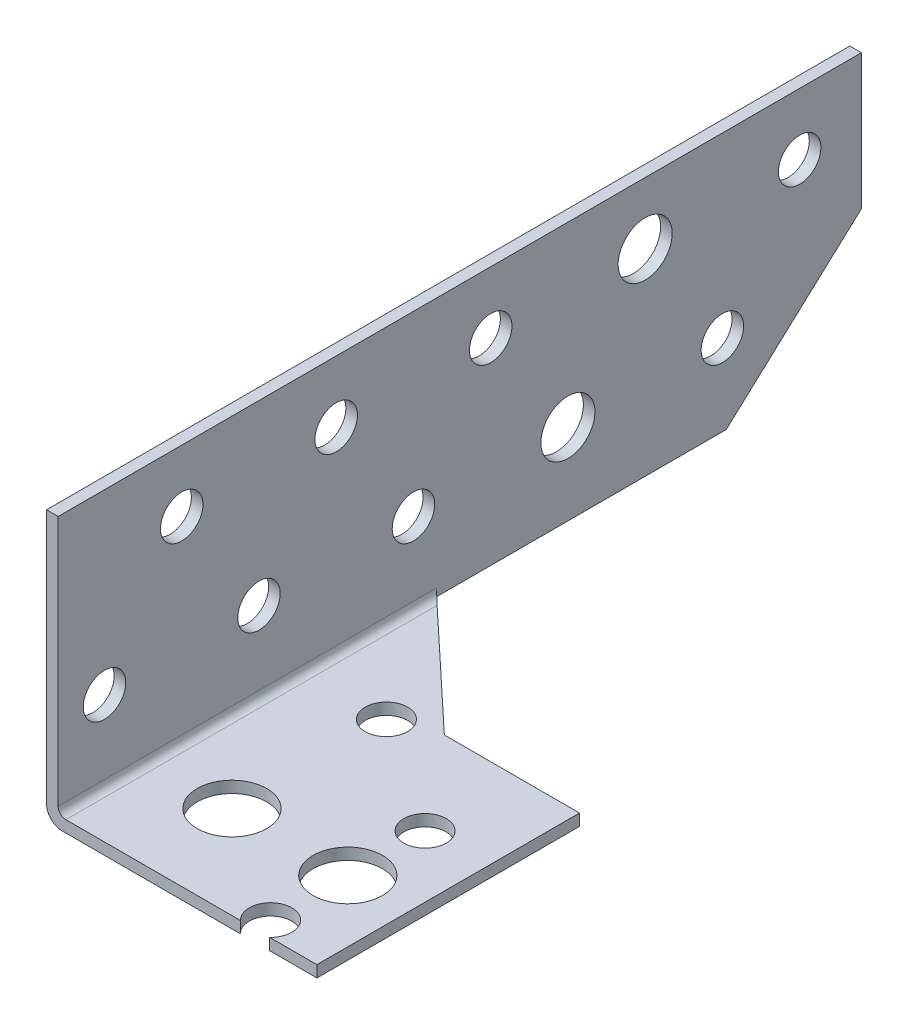
ISO-10303-21;
HEADER;
FILE_DESCRIPTION(('STEP AP214'),'2;1');
FILE_NAME('part.step','',(''),(''),'','','');
FILE_SCHEMA(('AUTOMOTIVE_DESIGN { 1 0 10303 214 1 1 1 1 }'));
ENDSEC;
DATA;
#1=APPLICATION_CONTEXT('core data for automotive mechanical design processes');
#2=APPLICATION_PROTOCOL_DEFINITION('international standard','automotive_design',2000,#1);
#3=PRODUCT_CONTEXT('',#1,'mechanical');
#4=PRODUCT('Part','Part','',(#3));
#5=PRODUCT_RELATED_PRODUCT_CATEGORY('part','',(#4));
#6=PRODUCT_DEFINITION_FORMATION('','',#4);
#7=PRODUCT_DEFINITION_CONTEXT('part definition',#1,'design');
#8=PRODUCT_DEFINITION('design','',#6,#7);
#9=PRODUCT_DEFINITION_SHAPE('','',#8);
#10=(LENGTH_UNIT() NAMED_UNIT(*) SI_UNIT(.MILLI.,.METRE.));
#11=(NAMED_UNIT(*) PLANE_ANGLE_UNIT() SI_UNIT($,.RADIAN.));
#12=(NAMED_UNIT(*) SI_UNIT($,.STERADIAN.) SOLID_ANGLE_UNIT());
#13=UNCERTAINTY_MEASURE_WITH_UNIT(LENGTH_MEASURE(1.E-05),#10,'distance_accuracy_value','');
#14=(GEOMETRIC_REPRESENTATION_CONTEXT(3) GLOBAL_UNCERTAINTY_ASSIGNED_CONTEXT((#13)) GLOBAL_UNIT_ASSIGNED_CONTEXT((#10,
#11,#12)) REPRESENTATION_CONTEXT('',''));
#15=CARTESIAN_POINT('',(0.,0.,0.));
#16=DIRECTION('',(0.,0.,1.));
#17=DIRECTION('',(1.,0.,0.));
#18=AXIS2_PLACEMENT_3D('',#15,#16,#17);
#19=CARTESIAN_POINT('',(-0.75,0.,210.));
#20=DIRECTION('',(1.,0.,0.));
#21=DIRECTION('',(0.,1.,0.));
#22=AXIS2_PLACEMENT_3D('',#19,#20,#21);
#23=PLANE('',#22);
#24=CARTESIAN_POINT('',(-0.750000000000001,9.5,28.));
#25=DIRECTION('',(1.,0.,0.));
#26=DIRECTION('',(0.,1.,0.));
#27=AXIS2_PLACEMENT_3D('',#24,#25,#26);
#28=CIRCLE('',#27,3.5);
#29=CARTESIAN_POINT('',(-0.750000000000001,13.,28.));
#30=VERTEX_POINT('',#29);
#31=EDGE_CURVE('E332',#30,#30,#28,.T.);
#32=ORIENTED_EDGE('',*,*,#31,.T.);
#33=EDGE_LOOP('',(#32));
#34=FACE_BOUND('',#33,.T.);
#35=CARTESIAN_POINT('',(-0.749999999999999,-5.5,38.));
#36=DIRECTION('',(1.,0.,0.));
#37=DIRECTION('',(0.,1.,0.));
#38=AXIS2_PLACEMENT_3D('',#35,#36,#37);
#39=CIRCLE('',#38,3.5);
#40=CARTESIAN_POINT('',(-0.749999999999999,-2.,38.));
#41=VERTEX_POINT('',#40);
#42=EDGE_CURVE('E336',#41,#41,#39,.T.);
#43=ORIENTED_EDGE('',*,*,#42,.T.);
#44=EDGE_LOOP('',(#43));
#45=FACE_BOUND('',#44,.T.);
#46=CARTESIAN_POINT('',(-0.749999999999999,-5.5,18.));
#47=DIRECTION('',(1.,0.,0.));
#48=DIRECTION('',(0.,1.,0.));
#49=AXIS2_PLACEMENT_3D('',#46,#47,#48);
#50=CIRCLE('',#49,2.75);
#51=CARTESIAN_POINT('',(-0.749999999999999,-2.75,18.));
#52=VERTEX_POINT('',#51);
#53=EDGE_CURVE('E257',#52,#52,#50,.T.);
#54=ORIENTED_EDGE('',*,*,#53,.T.);
#55=EDGE_LOOP('',(#54));
#56=FACE_BOUND('',#55,.T.);
#57=CARTESIAN_POINT('',(-0.750000000000001,9.49999999999999,88.));
#58=DIRECTION('',(1.,0.,0.));
#59=DIRECTION('',(0.,1.,0.));
#60=AXIS2_PLACEMENT_3D('',#57,#58,#59);
#61=CIRCLE('',#60,2.75000000000001);
#62=CARTESIAN_POINT('',(-0.750000000000002,12.25,88.));
#63=VERTEX_POINT('',#62);
#64=EDGE_CURVE('E254',#63,#63,#61,.T.);
#65=ORIENTED_EDGE('',*,*,#64,.T.);
#66=EDGE_LOOP('',(#65));
#67=FACE_BOUND('',#66,.T.);
#68=CARTESIAN_POINT('',(-0.750000000000001,9.49999999999999,68.));
#69=DIRECTION('',(1.,0.,0.));
#70=DIRECTION('',(0.,1.,0.));
#71=AXIS2_PLACEMENT_3D('',#68,#69,#70);
#72=CIRCLE('',#71,2.75000000000001);
#73=CARTESIAN_POINT('',(-0.750000000000002,12.25,68.));
#74=VERTEX_POINT('',#73);
#75=EDGE_CURVE('E251',#74,#74,#72,.T.);
#76=ORIENTED_EDGE('',*,*,#75,.T.);
#77=EDGE_LOOP('',(#76));
#78=FACE_BOUND('',#77,.T.);
#79=CARTESIAN_POINT('',(-0.750000000000001,9.5,48.));
#80=DIRECTION('',(1.,0.,0.));
#81=DIRECTION('',(0.,1.,0.));
#82=AXIS2_PLACEMENT_3D('',#79,#80,#81);
#83=CIRCLE('',#82,2.75);
#84=CARTESIAN_POINT('',(-0.750000000000002,12.25,48.));
#85=VERTEX_POINT('',#84);
#86=EDGE_CURVE('E248',#85,#85,#83,.T.);
#87=ORIENTED_EDGE('',*,*,#86,.T.);
#88=EDGE_LOOP('',(#87));
#89=FACE_BOUND('',#88,.T.);
#90=CARTESIAN_POINT('',(-0.749999999999999,-5.5,58.));
#91=DIRECTION('',(1.,0.,0.));
#92=DIRECTION('',(0.,1.,0.));
#93=AXIS2_PLACEMENT_3D('',#90,#91,#92);
#94=CIRCLE('',#93,2.75);
#95=CARTESIAN_POINT('',(-0.749999999999999,-2.75,58.));
#96=VERTEX_POINT('',#95);
#97=EDGE_CURVE('E245',#96,#96,#94,.T.);
#98=ORIENTED_EDGE('',*,*,#97,.T.);
#99=EDGE_LOOP('',(#98));
#100=FACE_BOUND('',#99,.T.);
#101=CARTESIAN_POINT('',(-0.749999999999999,-5.5,78.));
#102=DIRECTION('',(1.,0.,0.));
#103=DIRECTION('',(0.,1.,0.));
#104=AXIS2_PLACEMENT_3D('',#101,#102,#103);
#105=CIRCLE('',#104,2.75000000000001);
#106=CARTESIAN_POINT('',(-0.749999999999999,-2.74999999999999,78.));
#107=VERTEX_POINT('',#106);
#108=EDGE_CURVE('E242',#107,#107,#105,.T.);
#109=ORIENTED_EDGE('',*,*,#108,.T.);
#110=EDGE_LOOP('',(#109));
#111=FACE_BOUND('',#110,.T.);
#112=CARTESIAN_POINT('',(-0.749999999999999,-5.5,98.));
#113=DIRECTION('',(1.,0.,0.));
#114=DIRECTION('',(0.,1.,0.));
#115=AXIS2_PLACEMENT_3D('',#112,#113,#114);
#116=CIRCLE('',#115,2.75000000000001);
#117=CARTESIAN_POINT('',(-0.749999999999999,-2.74999999999999,98.));
#118=VERTEX_POINT('',#117);
#119=EDGE_CURVE('E239',#118,#118,#116,.T.);
#120=ORIENTED_EDGE('',*,*,#119,.T.);
#121=EDGE_LOOP('',(#120));
#122=FACE_BOUND('',#121,.T.);
#123=CARTESIAN_POINT('',(-0.750000000000001,9.5,8.00000000000001));
#124=DIRECTION('',(1.,0.,0.));
#125=DIRECTION('',(0.,1.,0.));
#126=AXIS2_PLACEMENT_3D('',#123,#124,#125);
#127=CIRCLE('',#126,2.75);
#128=CARTESIAN_POINT('',(-0.750000000000002,12.25,8.00000000000001));
#129=VERTEX_POINT('',#128);
#130=EDGE_CURVE('E236',#129,#129,#127,.T.);
#131=ORIENTED_EDGE('',*,*,#130,.T.);
#132=EDGE_LOOP('',(#131));
#133=FACE_BOUND('',#132,.T.);
#134=DIRECTION('',(0.,-1.,0.));
#135=VECTOR('',#134,1.);
#136=CARTESIAN_POINT('',(-0.75,0.,104.));
#137=LINE('',#136,#135);
#138=CARTESIAN_POINT('',(-0.750000000000002,17.5,104.));
#139=VERTEX_POINT('',#138);
#140=CARTESIAN_POINT('',(-0.749999999999997,-15.5,104.));
#141=VERTEX_POINT('',#140);
#142=EDGE_CURVE('E151',#139,#141,#137,.T.);
#143=ORIENTED_EDGE('',*,*,#142,.F.);
#144=DIRECTION('',(0.,0.,-1.));
#145=VECTOR('',#144,1.);
#146=CARTESIAN_POINT('',(-0.750000000000002,17.5,210.));
#147=LINE('',#146,#145);
#148=CARTESIAN_POINT('',(-0.750000000000002,17.5,0.));
#149=VERTEX_POINT('',#148);
#150=EDGE_CURVE('E49',#139,#149,#147,.T.);
#151=ORIENTED_EDGE('',*,*,#150,.T.);
#152=DIRECTION('',(0.,-1.,0.));
#153=VECTOR('',#152,1.);
#154=CARTESIAN_POINT('',(-0.75,0.,0.));
#155=LINE('',#154,#153);
#156=CARTESIAN_POINT('',(-0.75,0.,0.));
#157=VERTEX_POINT('',#156);
#158=EDGE_CURVE('E164',#149,#157,#155,.T.);
#159=ORIENTED_EDGE('',*,*,#158,.T.);
#160=DIRECTION('',(0.,0.674769199544936,-0.738028812002273));
#161=VECTOR('',#160,1.);
#162=CARTESIAN_POINT('',(-0.749999999999985,-104.579813250333,114.384170742552));
#163=LINE('',#162,#161);
#164=CARTESIAN_POINT('',(-0.749999999999998,-15.5,16.953125));
#165=VERTEX_POINT('',#164);
#166=EDGE_CURVE('E211',#165,#157,#163,.T.);
#167=ORIENTED_EDGE('',*,*,#166,.F.);
#168=DIRECTION('',(0.,0.,-1.));
#169=VECTOR('',#168,1.);
#170=CARTESIAN_POINT('',(-0.749999999999997,-15.5,210.));
#171=LINE('',#170,#169);
#172=EDGE_CURVE('E160',#165,#141,#171,.F.);
#173=ORIENTED_EDGE('',*,*,#172,.T.);
#174=EDGE_LOOP('',(#143,#151,#159,#167,#173));
#175=FACE_BOUND('',#174,.T.);
#176=ADVANCED_FACE('F46',(#34,#45,#56,#67,#78,#89,#100,#111,#122,#133,#175),#23,.F.);
#177=CARTESIAN_POINT('',(0.,-17.5,210.));
#178=DIRECTION('',(0.,1.,0.));
#179=DIRECTION('',(0.,0.,1.));
#180=AXIS2_PLACEMENT_3D('',#177,#178,#179);
#181=PLANE('',#180);
#182=CARTESIAN_POINT('',(11.25,-17.5,92.));
#183=DIRECTION('',(0.,1.,0.));
#184=DIRECTION('',(0.,0.,1.));
#185=AXIS2_PLACEMENT_3D('',#182,#183,#184);
#186=CIRCLE('',#185,4.5);
#187=CARTESIAN_POINT('',(11.25,-17.5,96.5));
#188=VERTEX_POINT('',#187);
#189=EDGE_CURVE('E260',#188,#188,#186,.T.);
#190=ORIENTED_EDGE('',*,*,#189,.T.);
#191=EDGE_LOOP('',(#190));
#192=FACE_BOUND('',#191,.T.);
#193=CARTESIAN_POINT('',(26.25,-17.5,92.));
#194=DIRECTION('',(0.,1.,0.));
#195=DIRECTION('',(0.,0.,1.));
#196=AXIS2_PLACEMENT_3D('',#193,#194,#195);
#197=CIRCLE('',#196,4.5);
#198=CARTESIAN_POINT('',(26.25,-17.5,96.5));
#199=VERTEX_POINT('',#198);
#200=EDGE_CURVE('E687',#199,#199,#197,.T.);
#201=ORIENTED_EDGE('',*,*,#200,.T.);
#202=EDGE_LOOP('',(#201));
#203=FACE_BOUND('',#202,.T.);
#204=CARTESIAN_POINT('',(26.25,-17.5,82.));
#205=DIRECTION('',(0.,1.,0.));
#206=DIRECTION('',(0.,0.,1.));
#207=AXIS2_PLACEMENT_3D('',#204,#205,#206);
#208=CIRCLE('',#207,2.75);
#209=CARTESIAN_POINT('',(26.25,-17.5,84.75));
#210=VERTEX_POINT('',#209);
#211=EDGE_CURVE('E163',#210,#210,#208,.T.);
#212=ORIENTED_EDGE('',*,*,#211,.T.);
#213=EDGE_LOOP('',(#212));
#214=FACE_BOUND('',#213,.T.);
#215=CARTESIAN_POINT('',(11.25,-17.5,72.));
#216=DIRECTION('',(0.,1.,0.));
#217=DIRECTION('',(0.,0.,1.));
#218=AXIS2_PLACEMENT_3D('',#215,#216,#217);
#219=CIRCLE('',#218,2.74999999999997);
#220=CARTESIAN_POINT('',(11.25,-17.5,74.75));
#221=VERTEX_POINT('',#220);
#222=EDGE_CURVE('E169',#221,#221,#219,.T.);
#223=ORIENTED_EDGE('',*,*,#222,.T.);
#224=EDGE_LOOP('',(#223));
#225=FACE_BOUND('',#224,.T.);
#226=DIRECTION('',(1.,0.,0.));
#227=VECTOR('',#226,1.);
#228=CARTESIAN_POINT('',(0.,-17.5,104.));
#229=LINE('',#228,#227);
#230=CARTESIAN_POINT('',(1.25,-17.5,104.));
#231=VERTEX_POINT('',#230);
#232=CARTESIAN_POINT('',(24.3625413911823,-17.5,104.));
#233=VERTEX_POINT('',#232);
#234=EDGE_CURVE('E152',#231,#233,#229,.T.);
#235=ORIENTED_EDGE('',*,*,#234,.F.);
#236=DIRECTION('',(0.,0.,-1.));
#237=VECTOR('',#236,1.);
#238=CARTESIAN_POINT('',(1.25,-17.5,210.));
#239=LINE('',#238,#237);
#240=CARTESIAN_POINT('',(1.25,-17.5,55.46875));
#241=VERTEX_POINT('',#240);
#242=EDGE_CURVE('E165',#231,#241,#239,.T.);
#243=ORIENTED_EDGE('',*,*,#242,.T.);
#244=DIRECTION('',(0.729537204140086,0.,0.683941128881329));
#245=VECTOR('',#244,1.);
#246=CARTESIAN_POINT('',(77.6897089397089,-17.5,127.130977130977));
#247=LINE('',#246,#245);
#248=CARTESIAN_POINT('',(16.75,-17.5,70.));
#249=VERTEX_POINT('',#248);
#250=EDGE_CURVE('E168',#241,#249,#247,.T.);
#251=ORIENTED_EDGE('',*,*,#250,.T.);
#252=DIRECTION('',(1.,0.,0.));
#253=VECTOR('',#252,1.);
#254=CARTESIAN_POINT('',(0.,-17.5,70.));
#255=LINE('',#254,#253);
#256=CARTESIAN_POINT('',(34.25,-17.5,70.));
#257=VERTEX_POINT('',#256);
#258=EDGE_CURVE('E226',#249,#257,#255,.T.);
#259=ORIENTED_EDGE('',*,*,#258,.T.);
#260=DIRECTION('',(0.,0.,-1.));
#261=VECTOR('',#260,1.);
#262=CARTESIAN_POINT('',(34.25,-17.5,210.));
#263=LINE('',#262,#261);
#264=CARTESIAN_POINT('',(34.25,-17.5,104.));
#265=VERTEX_POINT('',#264);
#266=EDGE_CURVE('E102',#265,#257,#263,.T.);
#267=ORIENTED_EDGE('',*,*,#266,.F.);
#268=CARTESIAN_POINT('',(28.1374586088177,-17.5,104.));
#269=VERTEX_POINT('',#268);
#270=EDGE_CURVE('E55',#269,#265,#229,.T.);
#271=ORIENTED_EDGE('',*,*,#270,.F.);
#272=CARTESIAN_POINT('',(26.25,-17.5,102.));
#273=DIRECTION('',(0.,1.,0.));
#274=DIRECTION('',(0.,0.,1.));
#275=AXIS2_PLACEMENT_3D('',#272,#273,#274);
#276=CIRCLE('',#275,2.75000000000001);
#277=EDGE_CURVE('E103',#269,#233,#276,.T.);
#278=ORIENTED_EDGE('',*,*,#277,.T.);
#279=EDGE_LOOP('',(#235,#243,#251,#259,#267,#271,#278));
#280=FACE_BOUND('',#279,.T.);
#281=ADVANCED_FACE('F319',(#192,#203,#214,#225,#280),#181,.F.);
#282=CARTESIAN_POINT('',(34.2500000000001,-1.58438077472549E-13,210.));
#283=DIRECTION('',(-1.,0.,0.));
#284=DIRECTION('',(0.,-1.,0.));
#285=AXIS2_PLACEMENT_3D('',#282,#283,#284);
#286=PLANE('',#285);
#287=DIRECTION('',(0.,-1.,0.));
#288=VECTOR('',#287,1.);
#289=CARTESIAN_POINT('',(34.25,33.,104.));
#290=LINE('',#289,#288);
#291=CARTESIAN_POINT('',(34.25,-16.,104.));
#292=VERTEX_POINT('',#291);
#293=EDGE_CURVE('E94',#292,#265,#290,.T.);
#294=ORIENTED_EDGE('',*,*,#293,.T.);
#295=ORIENTED_EDGE('',*,*,#266,.T.);
#296=DIRECTION('',(0.,1.,0.));
#297=VECTOR('',#296,1.);
#298=CARTESIAN_POINT('',(34.25,-78.,70.));
#299=LINE('',#298,#297);
#300=CARTESIAN_POINT('',(34.25,-16.,70.));
#301=VERTEX_POINT('',#300);
#302=EDGE_CURVE('E122',#257,#301,#299,.T.);
#303=ORIENTED_EDGE('',*,*,#302,.T.);
#304=DIRECTION('',(0.,0.,-1.));
#305=VECTOR('',#304,1.);
#306=CARTESIAN_POINT('',(34.25,-16.,210.));
#307=LINE('',#306,#305);
#308=EDGE_CURVE('E112',#292,#301,#307,.T.);
#309=ORIENTED_EDGE('',*,*,#308,.F.);
#310=EDGE_LOOP('',(#294,#295,#303,#309));
#311=FACE_BOUND('',#310,.T.);
#312=ADVANCED_FACE('F120',(#311),#286,.F.);
#313=CARTESIAN_POINT('',(0.,-16.,210.));
#314=DIRECTION('',(0.,1.,0.));
#315=DIRECTION('',(0.,0.,1.));
#316=AXIS2_PLACEMENT_3D('',#313,#314,#315);
#317=PLANE('',#316);
#318=CARTESIAN_POINT('',(11.25,-16.,92.));
#319=DIRECTION('',(0.,1.,0.));
#320=DIRECTION('',(0.,0.,1.));
#321=AXIS2_PLACEMENT_3D('',#318,#319,#320);
#322=CIRCLE('',#321,4.5);
#323=CARTESIAN_POINT('',(11.25,-16.,96.5));
#324=VERTEX_POINT('',#323);
#325=EDGE_CURVE('E681',#324,#324,#322,.T.);
#326=ORIENTED_EDGE('',*,*,#325,.F.);
#327=EDGE_LOOP('',(#326));
#328=FACE_BOUND('',#327,.T.);
#329=CARTESIAN_POINT('',(26.25,-16.,92.));
#330=DIRECTION('',(0.,1.,0.));
#331=DIRECTION('',(0.,0.,1.));
#332=AXIS2_PLACEMENT_3D('',#329,#330,#331);
#333=CIRCLE('',#332,4.5);
#334=CARTESIAN_POINT('',(26.25,-16.,96.5));
#335=VERTEX_POINT('',#334);
#336=EDGE_CURVE('E678',#335,#335,#333,.T.);
#337=ORIENTED_EDGE('',*,*,#336,.F.);
#338=EDGE_LOOP('',(#337));
#339=FACE_BOUND('',#338,.T.);
#340=CARTESIAN_POINT('',(11.25,-16.,72.));
#341=DIRECTION('',(0.,1.,0.));
#342=DIRECTION('',(0.,0.,1.));
#343=AXIS2_PLACEMENT_3D('',#340,#341,#342);
#344=CIRCLE('',#343,2.74999999999997);
#345=CARTESIAN_POINT('',(11.25,-16.,74.75));
#346=VERTEX_POINT('',#345);
#347=EDGE_CURVE('E149',#346,#346,#344,.T.);
#348=ORIENTED_EDGE('',*,*,#347,.F.);
#349=EDGE_LOOP('',(#348));
#350=FACE_BOUND('',#349,.T.);
#351=CARTESIAN_POINT('',(26.25,-16.,82.));
#352=DIRECTION('',(0.,1.,0.));
#353=DIRECTION('',(0.,0.,1.));
#354=AXIS2_PLACEMENT_3D('',#351,#352,#353);
#355=CIRCLE('',#354,2.75);
#356=CARTESIAN_POINT('',(26.25,-16.,84.75));
#357=VERTEX_POINT('',#356);
#358=EDGE_CURVE('E292',#357,#357,#355,.T.);
#359=ORIENTED_EDGE('',*,*,#358,.F.);
#360=EDGE_LOOP('',(#359));
#361=FACE_BOUND('',#360,.T.);
#362=DIRECTION('',(0.,0.,-1.));
#363=VECTOR('',#362,1.);
#364=CARTESIAN_POINT('',(1.75,-16.,153.));
#365=LINE('',#364,#363);
#366=CARTESIAN_POINT('',(1.75,-16.,55.9375));
#367=VERTEX_POINT('',#366);
#368=CARTESIAN_POINT('',(1.75,-16.,104.));
#369=VERTEX_POINT('',#368);
#370=EDGE_CURVE('E158',#367,#369,#365,.F.);
#371=ORIENTED_EDGE('',*,*,#370,.T.);
#372=DIRECTION('',(1.,0.,0.));
#373=VECTOR('',#372,1.);
#374=CARTESIAN_POINT('',(0.,-16.,104.));
#375=LINE('',#374,#373);
#376=CARTESIAN_POINT('',(24.3625413911823,-16.,104.));
#377=VERTEX_POINT('',#376);
#378=EDGE_CURVE('E117',#369,#377,#375,.T.);
#379=ORIENTED_EDGE('',*,*,#378,.T.);
#380=CARTESIAN_POINT('',(26.25,-16.,102.));
#381=DIRECTION('',(0.,1.,0.));
#382=DIRECTION('',(0.,0.,1.));
#383=AXIS2_PLACEMENT_3D('',#380,#381,#382);
#384=CIRCLE('',#383,2.75000000000001);
#385=CARTESIAN_POINT('',(28.1374586088177,-16.,104.));
#386=VERTEX_POINT('',#385);
#387=EDGE_CURVE('E116',#386,#377,#384,.T.);
#388=ORIENTED_EDGE('',*,*,#387,.F.);
#389=EDGE_CURVE('E97',#386,#292,#375,.T.);
#390=ORIENTED_EDGE('',*,*,#389,.T.);
#391=ORIENTED_EDGE('',*,*,#308,.T.);
#392=DIRECTION('',(1.,0.,0.));
#393=VECTOR('',#392,1.);
#394=CARTESIAN_POINT('',(34.25,-16.,70.));
#395=LINE('',#394,#393);
#396=CARTESIAN_POINT('',(16.75,-16.,70.));
#397=VERTEX_POINT('',#396);
#398=EDGE_CURVE('E231',#397,#301,#395,.T.);
#399=ORIENTED_EDGE('',*,*,#398,.F.);
#400=DIRECTION('',(0.729537204140086,0.,0.683941128881329));
#401=VECTOR('',#400,1.);
#402=CARTESIAN_POINT('',(16.75,-16.,70.));
#403=LINE('',#402,#401);
#404=EDGE_CURVE('E199',#367,#397,#403,.T.);
#405=ORIENTED_EDGE('',*,*,#404,.F.);
#406=EDGE_LOOP('',(#371,#379,#388,#390,#391,#399,#405));
#407=FACE_BOUND('',#406,.T.);
#408=ADVANCED_FACE('F109',(#328,#339,#350,#361,#407),#317,.T.);
#409=CARTESIAN_POINT('',(0.75,0.,210.));
#410=DIRECTION('',(1.,0.,0.));
#411=DIRECTION('',(0.,1.,0.));
#412=AXIS2_PLACEMENT_3D('',#409,#410,#411);
#413=PLANE('',#412);
#414=CARTESIAN_POINT('',(0.749999999999999,9.5,28.));
#415=DIRECTION('',(1.,0.,0.));
#416=DIRECTION('',(0.,1.,0.));
#417=AXIS2_PLACEMENT_3D('',#414,#415,#416);
#418=CIRCLE('',#417,3.5);
#419=CARTESIAN_POINT('',(0.749999999999998,13.,28.));
#420=VERTEX_POINT('',#419);
#421=EDGE_CURVE('E677',#420,#420,#418,.T.);
#422=ORIENTED_EDGE('',*,*,#421,.F.);
#423=EDGE_LOOP('',(#422));
#424=FACE_BOUND('',#423,.T.);
#425=CARTESIAN_POINT('',(0.750000000000001,-5.5,38.));
#426=DIRECTION('',(1.,0.,0.));
#427=DIRECTION('',(0.,1.,0.));
#428=AXIS2_PLACEMENT_3D('',#425,#426,#427);
#429=CIRCLE('',#428,3.5);
#430=CARTESIAN_POINT('',(0.75,-2.,38.));
#431=VERTEX_POINT('',#430);
#432=EDGE_CURVE('E701',#431,#431,#429,.T.);
#433=ORIENTED_EDGE('',*,*,#432,.F.);
#434=EDGE_LOOP('',(#433));
#435=FACE_BOUND('',#434,.T.);
#436=CARTESIAN_POINT('',(0.749999999999999,9.5,8.00000000000001));
#437=DIRECTION('',(1.,0.,0.));
#438=DIRECTION('',(0.,1.,0.));
#439=AXIS2_PLACEMENT_3D('',#436,#437,#438);
#440=CIRCLE('',#439,2.75);
#441=CARTESIAN_POINT('',(0.749999999999999,12.25,8.00000000000001));
#442=VERTEX_POINT('',#441);
#443=EDGE_CURVE('E276',#442,#442,#440,.T.);
#444=ORIENTED_EDGE('',*,*,#443,.F.);
#445=EDGE_LOOP('',(#444));
#446=FACE_BOUND('',#445,.T.);
#447=CARTESIAN_POINT('',(0.750000000000001,-5.5,98.));
#448=DIRECTION('',(1.,0.,0.));
#449=DIRECTION('',(0.,1.,0.));
#450=AXIS2_PLACEMENT_3D('',#447,#448,#449);
#451=CIRCLE('',#450,2.75000000000001);
#452=CARTESIAN_POINT('',(0.75,-2.74999999999999,98.));
#453=VERTEX_POINT('',#452);
#454=EDGE_CURVE('E273',#453,#453,#451,.T.);
#455=ORIENTED_EDGE('',*,*,#454,.F.);
#456=EDGE_LOOP('',(#455));
#457=FACE_BOUND('',#456,.T.);
#458=CARTESIAN_POINT('',(0.750000000000001,-5.5,78.));
#459=DIRECTION('',(1.,0.,0.));
#460=DIRECTION('',(0.,1.,0.));
#461=AXIS2_PLACEMENT_3D('',#458,#459,#460);
#462=CIRCLE('',#461,2.75000000000001);
#463=CARTESIAN_POINT('',(0.75,-2.74999999999999,78.));
#464=VERTEX_POINT('',#463);
#465=EDGE_CURVE('E277',#464,#464,#462,.T.);
#466=ORIENTED_EDGE('',*,*,#465,.F.);
#467=EDGE_LOOP('',(#466));
#468=FACE_BOUND('',#467,.T.);
#469=CARTESIAN_POINT('',(0.750000000000001,-5.5,58.));
#470=DIRECTION('',(1.,0.,0.));
#471=DIRECTION('',(0.,1.,0.));
#472=AXIS2_PLACEMENT_3D('',#469,#470,#471);
#473=CIRCLE('',#472,2.75);
#474=CARTESIAN_POINT('',(0.75,-2.75,58.));
#475=VERTEX_POINT('',#474);
#476=EDGE_CURVE('E270',#475,#475,#473,.T.);
#477=ORIENTED_EDGE('',*,*,#476,.F.);
#478=EDGE_LOOP('',(#477));
#479=FACE_BOUND('',#478,.T.);
#480=CARTESIAN_POINT('',(0.749999999999999,9.5,48.));
#481=DIRECTION('',(1.,0.,0.));
#482=DIRECTION('',(0.,1.,0.));
#483=AXIS2_PLACEMENT_3D('',#480,#481,#482);
#484=CIRCLE('',#483,2.75);
#485=CARTESIAN_POINT('',(0.749999999999999,12.25,48.));
#486=VERTEX_POINT('',#485);
#487=EDGE_CURVE('E267',#486,#486,#484,.T.);
#488=ORIENTED_EDGE('',*,*,#487,.F.);
#489=EDGE_LOOP('',(#488));
#490=FACE_BOUND('',#489,.T.);
#491=CARTESIAN_POINT('',(0.749999999999999,9.49999999999999,68.));
#492=DIRECTION('',(1.,0.,0.));
#493=DIRECTION('',(0.,1.,0.));
#494=AXIS2_PLACEMENT_3D('',#491,#492,#493);
#495=CIRCLE('',#494,2.75000000000001);
#496=CARTESIAN_POINT('',(0.749999999999999,12.25,68.));
#497=VERTEX_POINT('',#496);
#498=EDGE_CURVE('E264',#497,#497,#495,.T.);
#499=ORIENTED_EDGE('',*,*,#498,.F.);
#500=EDGE_LOOP('',(#499));
#501=FACE_BOUND('',#500,.T.);
#502=CARTESIAN_POINT('',(0.749999999999999,9.49999999999999,88.));
#503=DIRECTION('',(1.,0.,0.));
#504=DIRECTION('',(0.,1.,0.));
#505=AXIS2_PLACEMENT_3D('',#502,#503,#504);
#506=CIRCLE('',#505,2.75000000000001);
#507=CARTESIAN_POINT('',(0.749999999999999,12.25,88.));
#508=VERTEX_POINT('',#507);
#509=EDGE_CURVE('E261',#508,#508,#506,.T.);
#510=ORIENTED_EDGE('',*,*,#509,.F.);
#511=EDGE_LOOP('',(#510));
#512=FACE_BOUND('',#511,.T.);
#513=CARTESIAN_POINT('',(0.750000000000001,-5.5,18.));
#514=DIRECTION('',(1.,0.,0.));
#515=DIRECTION('',(0.,1.,0.));
#516=AXIS2_PLACEMENT_3D('',#513,#514,#515);
#517=CIRCLE('',#516,2.75);
#518=CARTESIAN_POINT('',(0.75,-2.75,18.));
#519=VERTEX_POINT('',#518);
#520=EDGE_CURVE('E201',#519,#519,#517,.T.);
#521=ORIENTED_EDGE('',*,*,#520,.F.);
#522=EDGE_LOOP('',(#521));
#523=FACE_BOUND('',#522,.T.);
#524=DIRECTION('',(0.,0.,-1.));
#525=VECTOR('',#524,1.);
#526=CARTESIAN_POINT('',(0.749999999999998,17.5,210.));
#527=LINE('',#526,#525);
#528=CARTESIAN_POINT('',(0.749999999999998,17.5,104.));
#529=VERTEX_POINT('',#528);
#530=CARTESIAN_POINT('',(0.749999999999998,17.5,0.));
#531=VERTEX_POINT('',#530);
#532=EDGE_CURVE('E130',#529,#531,#527,.T.);
#533=ORIENTED_EDGE('',*,*,#532,.F.);
#534=DIRECTION('',(0.,-1.,0.));
#535=VECTOR('',#534,1.);
#536=CARTESIAN_POINT('',(0.75,0.,104.));
#537=LINE('',#536,#535);
#538=CARTESIAN_POINT('',(0.750000000000002,-15.,104.));
#539=VERTEX_POINT('',#538);
#540=EDGE_CURVE('E123',#529,#539,#537,.T.);
#541=ORIENTED_EDGE('',*,*,#540,.T.);
#542=DIRECTION('',(0.,0.,-1.));
#543=VECTOR('',#542,1.);
#544=CARTESIAN_POINT('',(0.750000000000002,-15.,55.));
#545=LINE('',#544,#543);
#546=CARTESIAN_POINT('',(0.750000000000001,-15.,55.));
#547=VERTEX_POINT('',#546);
#548=EDGE_CURVE('E126',#539,#547,#545,.T.);
#549=ORIENTED_EDGE('',*,*,#548,.T.);
#550=DIRECTION('',(0.,1.,0.));
#551=VECTOR('',#550,1.);
#552=CARTESIAN_POINT('',(0.750000000000001,-78.,55.));
#553=LINE('',#552,#551);
#554=CARTESIAN_POINT('',(0.750000000000002,-16.,55.));
#555=VERTEX_POINT('',#554);
#556=EDGE_CURVE('E179',#555,#547,#553,.T.);
#557=ORIENTED_EDGE('',*,*,#556,.F.);
#558=DIRECTION('',(0.,0.,1.));
#559=VECTOR('',#558,1.);
#560=CARTESIAN_POINT('',(0.750000000000002,-16.,55.));
#561=LINE('',#560,#559);
#562=CARTESIAN_POINT('',(0.750000000000002,-16.,17.5));
#563=VERTEX_POINT('',#562);
#564=EDGE_CURVE('E289',#563,#555,#561,.T.);
#565=ORIENTED_EDGE('',*,*,#564,.F.);
#566=DIRECTION('',(0.,0.674769199544936,-0.738028812002273));
#567=VECTOR('',#566,1.);
#568=CARTESIAN_POINT('',(0.750000000000013,-104.579813250333,114.384170742552));
#569=LINE('',#568,#567);
#570=CARTESIAN_POINT('',(0.750000000000001,0.,0.));
#571=VERTEX_POINT('',#570);
#572=EDGE_CURVE('E142',#563,#571,#569,.T.);
#573=ORIENTED_EDGE('',*,*,#572,.T.);
#574=DIRECTION('',(0.,-1.,0.));
#575=VECTOR('',#574,1.);
#576=CARTESIAN_POINT('',(0.75,0.,0.));
#577=LINE('',#576,#575);
#578=EDGE_CURVE('E215',#531,#571,#577,.T.);
#579=ORIENTED_EDGE('',*,*,#578,.F.);
#580=EDGE_LOOP('',(#533,#541,#549,#557,#565,#573,#579));
#581=FACE_BOUND('',#580,.T.);
#582=ADVANCED_FACE('F176',(#424,#435,#446,#457,#468,#479,#490,#501,#512,#523,#581),#413,.T.);
#583=CARTESIAN_POINT('',(0.,17.5,210.));
#584=DIRECTION('',(0.,1.,0.));
#585=DIRECTION('',(0.,0.,1.));
#586=AXIS2_PLACEMENT_3D('',#583,#584,#585);
#587=PLANE('',#586);
#588=ORIENTED_EDGE('',*,*,#150,.F.);
#589=DIRECTION('',(1.,0.,0.));
#590=VECTOR('',#589,1.);
#591=CARTESIAN_POINT('',(0.,17.5,104.));
#592=LINE('',#591,#590);
#593=EDGE_CURVE('E133',#139,#529,#592,.T.);
#594=ORIENTED_EDGE('',*,*,#593,.T.);
#595=ORIENTED_EDGE('',*,*,#532,.T.);
#596=DIRECTION('',(1.,0.,0.));
#597=VECTOR('',#596,1.);
#598=CARTESIAN_POINT('',(0.,17.5,0.));
#599=LINE('',#598,#597);
#600=EDGE_CURVE('E212',#149,#531,#599,.T.);
#601=ORIENTED_EDGE('',*,*,#600,.F.);
#602=EDGE_LOOP('',(#588,#594,#595,#601));
#603=FACE_BOUND('',#602,.T.);
#604=ADVANCED_FACE('F316',(#603),#587,.T.);
#605=CARTESIAN_POINT('',(1.75,-15.,210.));
#606=DIRECTION('',(0.,0.,1.));
#607=DIRECTION('',(1.,0.,0.));
#608=AXIS2_PLACEMENT_3D('',#605,#606,#607);
#609=CYLINDRICAL_SURFACE('',#608,1.);
#610=CARTESIAN_POINT('',(1.75,-15.,104.));
#611=DIRECTION('',(0.,0.,1.));
#612=DIRECTION('',(1.,0.,0.));
#613=AXIS2_PLACEMENT_3D('',#610,#611,#612);
#614=CIRCLE('',#613,1.);
#615=EDGE_CURVE('E154',#369,#539,#614,.F.);
#616=ORIENTED_EDGE('',*,*,#615,.F.);
#617=ORIENTED_EDGE('',*,*,#370,.F.);
#618=CARTESIAN_POINT('',(1.75,-15.,55.9375));
#619=DIRECTION('',(-0.683941128881329,0.,0.729537204140086));
#620=DIRECTION('',(0.729537204140086,0.,0.683941128881329));
#621=AXIS2_PLACEMENT_3D('',#618,#619,#620);
#622=ELLIPSE('',#621,1.37073201246633,1.);
#623=EDGE_CURVE('E191',#547,#367,#622,.T.);
#624=ORIENTED_EDGE('',*,*,#623,.F.);
#625=ORIENTED_EDGE('',*,*,#548,.F.);
#626=EDGE_LOOP('',(#616,#617,#624,#625));
#627=FACE_BOUND('',#626,.T.);
#628=ADVANCED_FACE('F198',(#627),#609,.F.);
#629=CARTESIAN_POINT('',(1.25,-15.5,210.));
#630=DIRECTION('',(0.,0.,-1.));
#631=DIRECTION('',(-1.,0.,0.));
#632=AXIS2_PLACEMENT_3D('',#629,#630,#631);
#633=CYLINDRICAL_SURFACE('',#632,2.);
#634=ORIENTED_EDGE('',*,*,#242,.F.);
#635=CARTESIAN_POINT('',(1.25,-15.5,104.));
#636=DIRECTION('',(0.,0.,1.));
#637=DIRECTION('',(1.,0.,0.));
#638=AXIS2_PLACEMENT_3D('',#635,#636,#637);
#639=CIRCLE('',#638,2.);
#640=EDGE_CURVE('E132',#231,#141,#639,.F.);
#641=ORIENTED_EDGE('',*,*,#640,.T.);
#642=ORIENTED_EDGE('',*,*,#172,.F.);
#643=CARTESIAN_POINT('',(1.25,-15.5,16.953125));
#644=DIRECTION('',(0.,-0.738028812002273,-0.674769199544936));
#645=DIRECTION('',(0.,0.674769199544936,-0.738028812002273));
#646=AXIS2_PLACEMENT_3D('',#643,#644,#645);
#647=ELLIPSE('',#646,2.96397642534484,2.);
#648=CARTESIAN_POINT('',(-0.686491673103705,-16.,17.5));
#649=VERTEX_POINT('',#648);
#650=EDGE_CURVE('E222',#649,#165,#647,.T.);
#651=ORIENTED_EDGE('',*,*,#650,.F.);
#652=DIRECTION('',(0.,0.,-1.));
#653=VECTOR('',#652,1.);
#654=CARTESIAN_POINT('',(-0.686491673103705,-16.,210.));
#655=LINE('',#654,#653);
#656=CARTESIAN_POINT('',(-0.686491673103705,-16.,55.));
#657=VERTEX_POINT('',#656);
#658=EDGE_CURVE('E288',#657,#649,#655,.T.);
#659=ORIENTED_EDGE('',*,*,#658,.F.);
#660=CARTESIAN_POINT('',(1.25,-15.5,55.));
#661=DIRECTION('',(0.,0.,1.));
#662=DIRECTION('',(1.,0.,0.));
#663=AXIS2_PLACEMENT_3D('',#660,#661,#662);
#664=CIRCLE('',#663,2.);
#665=CARTESIAN_POINT('',(0.750000000000002,-17.4364916731037,55.));
#666=VERTEX_POINT('',#665);
#667=EDGE_CURVE('E284',#666,#657,#664,.F.);
#668=ORIENTED_EDGE('',*,*,#667,.F.);
#669=CARTESIAN_POINT('',(1.25,-15.5,55.46875));
#670=DIRECTION('',(-0.683941128881329,0.,0.729537204140086));
#671=DIRECTION('',(-0.729537204140086,0.,-0.683941128881329));
#672=AXIS2_PLACEMENT_3D('',#669,#670,#671);
#673=ELLIPSE('',#672,2.74146402493266,2.);
#674=EDGE_CURVE('E205',#241,#666,#673,.F.);
#675=ORIENTED_EDGE('',*,*,#674,.F.);
#676=EDGE_LOOP('',(#634,#641,#642,#651,#659,#668,#675));
#677=FACE_BOUND('',#676,.T.);
#678=ADVANCED_FACE('F399',(#677),#633,.T.);
#679=CARTESIAN_POINT('',(26.25,-21.,102.));
#680=DIRECTION('',(0.,1.,0.));
#681=DIRECTION('',(0.,0.,1.));
#682=AXIS2_PLACEMENT_3D('',#679,#680,#681);
#683=CYLINDRICAL_SURFACE('',#682,2.75000000000001);
#684=DIRECTION('',(0.,1.,0.));
#685=VECTOR('',#684,1.);
#686=CARTESIAN_POINT('',(28.1374586088177,-21.,104.));
#687=LINE('',#686,#685);
#688=EDGE_CURVE('E11',#386,#269,#687,.F.);
#689=ORIENTED_EDGE('',*,*,#688,.F.);
#690=ORIENTED_EDGE('',*,*,#387,.T.);
#691=DIRECTION('',(0.,1.,0.));
#692=VECTOR('',#691,1.);
#693=CARTESIAN_POINT('',(24.3625413911823,-21.,104.));
#694=LINE('',#693,#692);
#695=EDGE_CURVE('E155',#233,#377,#694,.T.);
#696=ORIENTED_EDGE('',*,*,#695,.F.);
#697=ORIENTED_EDGE('',*,*,#277,.F.);
#698=EDGE_LOOP('',(#689,#690,#696,#697));
#699=FACE_BOUND('',#698,.T.);
#700=ADVANCED_FACE('F408',(#699),#683,.F.);
#701=CARTESIAN_POINT('',(0.,0.,0.));
#702=DIRECTION('',(0.,0.,1.));
#703=DIRECTION('',(1.,0.,0.));
#704=AXIS2_PLACEMENT_3D('',#701,#702,#703);
#705=PLANE('',#704);
#706=DIRECTION('',(1.,0.,0.));
#707=VECTOR('',#706,1.);
#708=CARTESIAN_POINT('',(0.,0.,0.));
#709=LINE('',#708,#707);
#710=EDGE_CURVE('E207',#157,#571,#709,.T.);
#711=ORIENTED_EDGE('',*,*,#710,.F.);
#712=ORIENTED_EDGE('',*,*,#158,.F.);
#713=ORIENTED_EDGE('',*,*,#600,.T.);
#714=ORIENTED_EDGE('',*,*,#578,.T.);
#715=EDGE_LOOP('',(#711,#712,#713,#714));
#716=FACE_BOUND('',#715,.T.);
#717=ADVANCED_FACE('F364',(#716),#705,.F.);
#718=CARTESIAN_POINT('',(62.75,0.,0.));
#719=DIRECTION('',(0.,-0.738028812002273,-0.674769199544936));
#720=DIRECTION('',(0.,0.674769199544936,-0.738028812002273));
#721=AXIS2_PLACEMENT_3D('',#718,#719,#720);
#722=PLANE('',#721);
#723=DIRECTION('',(-1.,0.,0.));
#724=VECTOR('',#723,1.);
#725=CARTESIAN_POINT('',(62.75,-16.,17.5));
#726=LINE('',#725,#724);
#727=EDGE_CURVE('E218',#563,#649,#726,.T.);
#728=ORIENTED_EDGE('',*,*,#727,.T.);
#729=ORIENTED_EDGE('',*,*,#650,.T.);
#730=ORIENTED_EDGE('',*,*,#166,.T.);
#731=ORIENTED_EDGE('',*,*,#710,.T.);
#732=ORIENTED_EDGE('',*,*,#572,.F.);
#733=EDGE_LOOP('',(#728,#729,#730,#731,#732));
#734=FACE_BOUND('',#733,.T.);
#735=ADVANCED_FACE('F394',(#734),#722,.T.);
#736=CARTESIAN_POINT('',(34.25,-78.,70.));
#737=DIRECTION('',(0.,0.,1.));
#738=DIRECTION('',(1.,0.,0.));
#739=AXIS2_PLACEMENT_3D('',#736,#737,#738);
#740=PLANE('',#739);
#741=DIRECTION('',(0.,1.,0.));
#742=VECTOR('',#741,1.);
#743=CARTESIAN_POINT('',(16.75,-78.,70.));
#744=LINE('',#743,#742);
#745=EDGE_CURVE('E210',#249,#397,#744,.T.);
#746=ORIENTED_EDGE('',*,*,#745,.T.);
#747=ORIENTED_EDGE('',*,*,#398,.T.);
#748=ORIENTED_EDGE('',*,*,#302,.F.);
#749=ORIENTED_EDGE('',*,*,#258,.F.);
#750=EDGE_LOOP('',(#746,#747,#748,#749));
#751=FACE_BOUND('',#750,.T.);
#752=ADVANCED_FACE('F419',(#751),#740,.F.);
#753=CARTESIAN_POINT('',(16.75,-78.,70.));
#754=DIRECTION('',(-0.683941128881329,0.,0.729537204140086));
#755=DIRECTION('',(0.729537204140086,0.,0.683941128881329));
#756=AXIS2_PLACEMENT_3D('',#753,#754,#755);
#757=PLANE('',#756);
#758=ORIENTED_EDGE('',*,*,#250,.F.);
#759=ORIENTED_EDGE('',*,*,#674,.T.);
#760=EDGE_CURVE('E195',#666,#555,#553,.T.);
#761=ORIENTED_EDGE('',*,*,#760,.T.);
#762=ORIENTED_EDGE('',*,*,#556,.T.);
#763=ORIENTED_EDGE('',*,*,#623,.T.);
#764=ORIENTED_EDGE('',*,*,#404,.T.);
#765=ORIENTED_EDGE('',*,*,#745,.F.);
#766=EDGE_LOOP('',(#758,#759,#761,#762,#763,#764,#765));
#767=FACE_BOUND('',#766,.T.);
#768=ADVANCED_FACE('F188',(#767),#757,.F.);
#769=CARTESIAN_POINT('',(-4.25,-5.5,18.));
#770=DIRECTION('',(1.,0.,0.));
#771=DIRECTION('',(0.,1.,0.));
#772=AXIS2_PLACEMENT_3D('',#769,#770,#771);
#773=CYLINDRICAL_SURFACE('',#772,2.75);
#774=ORIENTED_EDGE('',*,*,#520,.T.);
#775=EDGE_LOOP('',(#774));
#776=FACE_BOUND('',#775,.T.);
#777=ORIENTED_EDGE('',*,*,#53,.F.);
#778=EDGE_LOOP('',(#777));
#779=FACE_BOUND('',#778,.T.);
#780=ADVANCED_FACE('F426',(#776,#779),#773,.F.);
#781=CARTESIAN_POINT('',(-4.25,9.49999999999999,88.));
#782=DIRECTION('',(1.,0.,0.));
#783=DIRECTION('',(0.,1.,0.));
#784=AXIS2_PLACEMENT_3D('',#781,#782,#783);
#785=CYLINDRICAL_SURFACE('',#784,2.75000000000001);
#786=ORIENTED_EDGE('',*,*,#509,.T.);
#787=EDGE_LOOP('',(#786));
#788=FACE_BOUND('',#787,.T.);
#789=ORIENTED_EDGE('',*,*,#64,.F.);
#790=EDGE_LOOP('',(#789));
#791=FACE_BOUND('',#790,.T.);
#792=ADVANCED_FACE('F431',(#788,#791),#785,.F.);
#793=CARTESIAN_POINT('',(-4.25,9.49999999999999,68.));
#794=DIRECTION('',(1.,0.,0.));
#795=DIRECTION('',(0.,1.,0.));
#796=AXIS2_PLACEMENT_3D('',#793,#794,#795);
#797=CYLINDRICAL_SURFACE('',#796,2.75000000000001);
#798=ORIENTED_EDGE('',*,*,#498,.T.);
#799=EDGE_LOOP('',(#798));
#800=FACE_BOUND('',#799,.T.);
#801=ORIENTED_EDGE('',*,*,#75,.F.);
#802=EDGE_LOOP('',(#801));
#803=FACE_BOUND('',#802,.T.);
#804=ADVANCED_FACE('F434',(#800,#803),#797,.F.);
#805=CARTESIAN_POINT('',(-4.25,9.5,48.));
#806=DIRECTION('',(1.,0.,0.));
#807=DIRECTION('',(0.,1.,0.));
#808=AXIS2_PLACEMENT_3D('',#805,#806,#807);
#809=CYLINDRICAL_SURFACE('',#808,2.75);
#810=ORIENTED_EDGE('',*,*,#487,.T.);
#811=EDGE_LOOP('',(#810));
#812=FACE_BOUND('',#811,.T.);
#813=ORIENTED_EDGE('',*,*,#86,.F.);
#814=EDGE_LOOP('',(#813));
#815=FACE_BOUND('',#814,.T.);
#816=ADVANCED_FACE('F438',(#812,#815),#809,.F.);
#817=CARTESIAN_POINT('',(-4.25,-5.5,58.));
#818=DIRECTION('',(1.,0.,0.));
#819=DIRECTION('',(0.,1.,0.));
#820=AXIS2_PLACEMENT_3D('',#817,#818,#819);
#821=CYLINDRICAL_SURFACE('',#820,2.75);
#822=ORIENTED_EDGE('',*,*,#476,.T.);
#823=EDGE_LOOP('',(#822));
#824=FACE_BOUND('',#823,.T.);
#825=ORIENTED_EDGE('',*,*,#97,.F.);
#826=EDGE_LOOP('',(#825));
#827=FACE_BOUND('',#826,.T.);
#828=ADVANCED_FACE('F442',(#824,#827),#821,.F.);
#829=CARTESIAN_POINT('',(-4.25,-5.5,78.));
#830=DIRECTION('',(1.,0.,0.));
#831=DIRECTION('',(0.,1.,0.));
#832=AXIS2_PLACEMENT_3D('',#829,#830,#831);
#833=CYLINDRICAL_SURFACE('',#832,2.75000000000001);
#834=ORIENTED_EDGE('',*,*,#465,.T.);
#835=EDGE_LOOP('',(#834));
#836=FACE_BOUND('',#835,.T.);
#837=ORIENTED_EDGE('',*,*,#108,.F.);
#838=EDGE_LOOP('',(#837));
#839=FACE_BOUND('',#838,.T.);
#840=ADVANCED_FACE('F451',(#836,#839),#833,.F.);
#841=CARTESIAN_POINT('',(-4.25,-5.5,98.));
#842=DIRECTION('',(1.,0.,0.));
#843=DIRECTION('',(0.,1.,0.));
#844=AXIS2_PLACEMENT_3D('',#841,#842,#843);
#845=CYLINDRICAL_SURFACE('',#844,2.75000000000001);
#846=ORIENTED_EDGE('',*,*,#454,.T.);
#847=EDGE_LOOP('',(#846));
#848=FACE_BOUND('',#847,.T.);
#849=ORIENTED_EDGE('',*,*,#119,.F.);
#850=EDGE_LOOP('',(#849));
#851=FACE_BOUND('',#850,.T.);
#852=ADVANCED_FACE('F447',(#848,#851),#845,.F.);
#853=CARTESIAN_POINT('',(-4.25,9.5,8.00000000000001));
#854=DIRECTION('',(1.,0.,0.));
#855=DIRECTION('',(0.,1.,0.));
#856=AXIS2_PLACEMENT_3D('',#853,#854,#855);
#857=CYLINDRICAL_SURFACE('',#856,2.75);
#858=ORIENTED_EDGE('',*,*,#443,.T.);
#859=EDGE_LOOP('',(#858));
#860=FACE_BOUND('',#859,.T.);
#861=ORIENTED_EDGE('',*,*,#130,.F.);
#862=EDGE_LOOP('',(#861));
#863=FACE_BOUND('',#862,.T.);
#864=ADVANCED_FACE('F450',(#860,#863),#857,.F.);
#865=CARTESIAN_POINT('',(-4.25,-17.4364916731037,55.));
#866=DIRECTION('',(0.,0.,1.));
#867=DIRECTION('',(1.,0.,0.));
#868=AXIS2_PLACEMENT_3D('',#865,#866,#867);
#869=PLANE('',#868);
#870=ORIENTED_EDGE('',*,*,#667,.T.);
#871=DIRECTION('',(1.,0.,0.));
#872=VECTOR('',#871,1.);
#873=CARTESIAN_POINT('',(-4.25,-16.,55.));
#874=LINE('',#873,#872);
#875=EDGE_CURVE('E285',#657,#555,#874,.T.);
#876=ORIENTED_EDGE('',*,*,#875,.T.);
#877=ORIENTED_EDGE('',*,*,#760,.F.);
#878=EDGE_LOOP('',(#870,#876,#877));
#879=FACE_BOUND('',#878,.T.);
#880=ADVANCED_FACE('F461',(#879),#869,.F.);
#881=CARTESIAN_POINT('',(-4.25,-16.,55.));
#882=DIRECTION('',(0.,1.,0.));
#883=DIRECTION('',(-1.,0.,0.));
#884=AXIS2_PLACEMENT_3D('',#881,#882,#883);
#885=PLANE('',#884);
#886=ORIENTED_EDGE('',*,*,#658,.T.);
#887=ORIENTED_EDGE('',*,*,#727,.F.);
#888=ORIENTED_EDGE('',*,*,#564,.T.);
#889=ORIENTED_EDGE('',*,*,#875,.F.);
#890=EDGE_LOOP('',(#886,#887,#888,#889));
#891=FACE_BOUND('',#890,.T.);
#892=ADVANCED_FACE('F413',(#891),#885,.F.);
#893=CARTESIAN_POINT('',(26.25,-21.,82.));
#894=DIRECTION('',(0.,1.,0.));
#895=DIRECTION('',(0.,0.,1.));
#896=AXIS2_PLACEMENT_3D('',#893,#894,#895);
#897=CYLINDRICAL_SURFACE('',#896,2.75);
#898=ORIENTED_EDGE('',*,*,#358,.T.);
#899=EDGE_LOOP('',(#898));
#900=FACE_BOUND('',#899,.T.);
#901=ORIENTED_EDGE('',*,*,#211,.F.);
#902=EDGE_LOOP('',(#901));
#903=FACE_BOUND('',#902,.T.);
#904=ADVANCED_FACE('F467',(#900,#903),#897,.F.);
#905=CARTESIAN_POINT('',(11.25,-21.,72.));
#906=DIRECTION('',(0.,1.,0.));
#907=DIRECTION('',(0.,0.,1.));
#908=AXIS2_PLACEMENT_3D('',#905,#906,#907);
#909=CYLINDRICAL_SURFACE('',#908,2.74999999999997);
#910=ORIENTED_EDGE('',*,*,#347,.T.);
#911=EDGE_LOOP('',(#910));
#912=FACE_BOUND('',#911,.T.);
#913=ORIENTED_EDGE('',*,*,#222,.F.);
#914=EDGE_LOOP('',(#913));
#915=FACE_BOUND('',#914,.T.);
#916=ADVANCED_FACE('F305',(#912,#915),#909,.F.);
#917=CARTESIAN_POINT('',(34.25,33.,104.));
#918=DIRECTION('',(0.,0.,1.));
#919=DIRECTION('',(1.,0.,0.));
#920=AXIS2_PLACEMENT_3D('',#917,#918,#919);
#921=PLANE('',#920);
#922=ORIENTED_EDGE('',*,*,#142,.T.);
#923=ORIENTED_EDGE('',*,*,#640,.F.);
#924=ORIENTED_EDGE('',*,*,#234,.T.);
#925=ORIENTED_EDGE('',*,*,#695,.T.);
#926=ORIENTED_EDGE('',*,*,#378,.F.);
#927=ORIENTED_EDGE('',*,*,#615,.T.);
#928=ORIENTED_EDGE('',*,*,#540,.F.);
#929=ORIENTED_EDGE('',*,*,#593,.F.);
#930=EDGE_LOOP('',(#922,#923,#924,#925,#926,#927,#928,#929));
#931=FACE_BOUND('',#930,.T.);
#932=ADVANCED_FACE('F403',(#931),#921,.T.);
#933=ORIENTED_EDGE('',*,*,#270,.T.);
#934=ORIENTED_EDGE('',*,*,#293,.F.);
#935=ORIENTED_EDGE('',*,*,#389,.F.);
#936=ORIENTED_EDGE('',*,*,#688,.T.);
#937=EDGE_LOOP('',(#933,#934,#935,#936));
#938=FACE_BOUND('',#937,.T.);
#939=ADVANCED_FACE('F96',(#938),#921,.T.);
#940=CARTESIAN_POINT('',(26.25,-26.,92.));
#941=DIRECTION('',(0.,1.,0.));
#942=DIRECTION('',(0.,0.,1.));
#943=AXIS2_PLACEMENT_3D('',#940,#941,#942);
#944=CYLINDRICAL_SURFACE('',#943,4.5);
#945=ORIENTED_EDGE('',*,*,#336,.T.);
#946=EDGE_LOOP('',(#945));
#947=FACE_BOUND('',#946,.T.);
#948=ORIENTED_EDGE('',*,*,#200,.F.);
#949=EDGE_LOOP('',(#948));
#950=FACE_BOUND('',#949,.T.);
#951=ADVANCED_FACE('F622',(#947,#950),#944,.F.);
#952=CARTESIAN_POINT('',(11.25,-26.,92.));
#953=DIRECTION('',(0.,1.,0.));
#954=DIRECTION('',(0.,0.,1.));
#955=AXIS2_PLACEMENT_3D('',#952,#953,#954);
#956=CYLINDRICAL_SURFACE('',#955,4.5);
#957=ORIENTED_EDGE('',*,*,#325,.T.);
#958=EDGE_LOOP('',(#957));
#959=FACE_BOUND('',#958,.T.);
#960=ORIENTED_EDGE('',*,*,#189,.F.);
#961=EDGE_LOOP('',(#960));
#962=FACE_BOUND('',#961,.T.);
#963=ADVANCED_FACE('F633',(#959,#962),#956,.F.);
#964=CARTESIAN_POINT('',(-9.25,-5.5,38.));
#965=DIRECTION('',(1.,0.,0.));
#966=DIRECTION('',(0.,1.,0.));
#967=AXIS2_PLACEMENT_3D('',#964,#965,#966);
#968=CYLINDRICAL_SURFACE('',#967,3.5);
#969=ORIENTED_EDGE('',*,*,#432,.T.);
#970=EDGE_LOOP('',(#969));
#971=FACE_BOUND('',#970,.T.);
#972=ORIENTED_EDGE('',*,*,#42,.F.);
#973=EDGE_LOOP('',(#972));
#974=FACE_BOUND('',#973,.T.);
#975=ADVANCED_FACE('F644',(#971,#974),#968,.F.);
#976=CARTESIAN_POINT('',(-9.25,9.5,28.));
#977=DIRECTION('',(1.,0.,0.));
#978=DIRECTION('',(0.,1.,0.));
#979=AXIS2_PLACEMENT_3D('',#976,#977,#978);
#980=CYLINDRICAL_SURFACE('',#979,3.5);
#981=ORIENTED_EDGE('',*,*,#421,.T.);
#982=EDGE_LOOP('',(#981));
#983=FACE_BOUND('',#982,.T.);
#984=ORIENTED_EDGE('',*,*,#31,.F.);
#985=EDGE_LOOP('',(#984));
#986=FACE_BOUND('',#985,.T.);
#987=ADVANCED_FACE('F655',(#983,#986),#980,.F.);
#988=CLOSED_SHELL('',(#176,#281,#312,#408,#582,#604,#628,#678,#700,#717,#735,#752,#768,#780,
#792,#804,#816,#828,#840,#852,#864,#880,#892,#904,#916,#932,#939,#951,#963,#975,#987));
#989=MANIFOLD_SOLID_BREP('B2',#988);
#990=ADVANCED_BREP_SHAPE_REPRESENTATION('',(#18,#989),#14);
#991=SHAPE_DEFINITION_REPRESENTATION(#9,#990);
ENDSEC;
END-ISO-10303-21;
